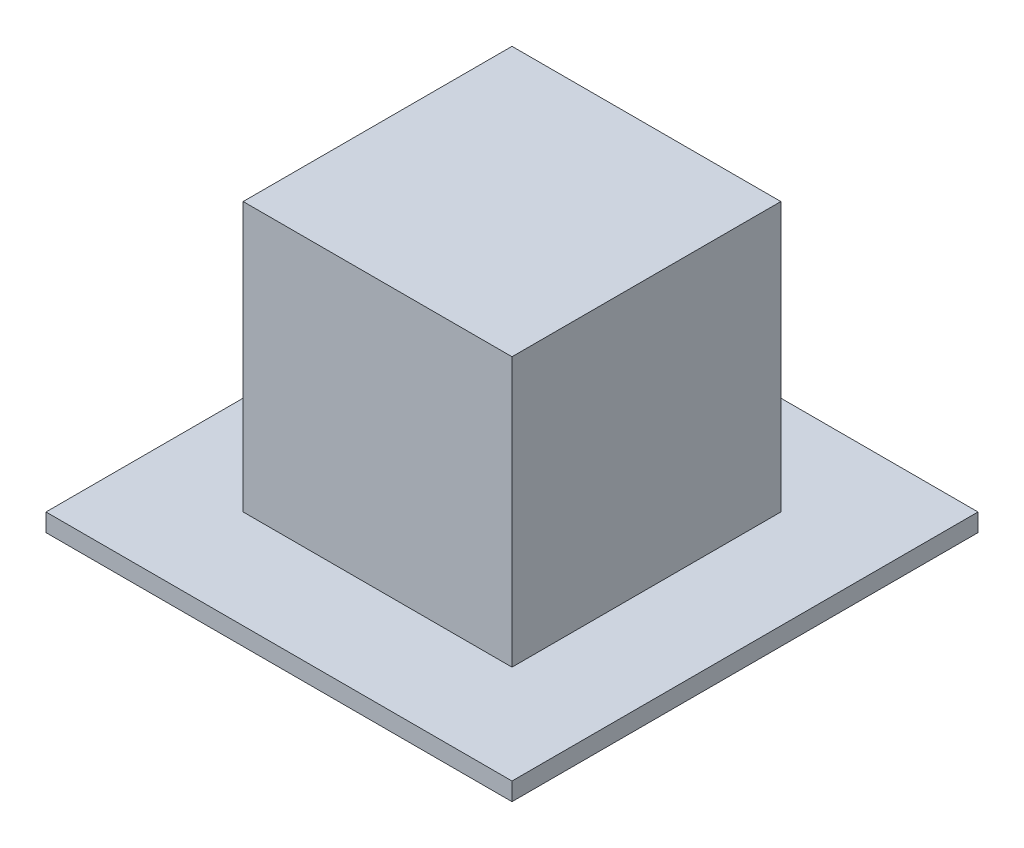
ISO-10303-21;
HEADER;
FILE_DESCRIPTION(('STEP AP214'),'2;1');
FILE_NAME('part.step','',(''),(''),'','','');
FILE_SCHEMA(('AUTOMOTIVE_DESIGN { 1 0 10303 214 1 1 1 1 }'));
ENDSEC;
DATA;
#1=APPLICATION_CONTEXT('core data for automotive mechanical design processes');
#2=APPLICATION_PROTOCOL_DEFINITION('international standard','automotive_design',2000,#1);
#3=PRODUCT_CONTEXT('',#1,'mechanical');
#4=PRODUCT('Part','Part','',(#3));
#5=PRODUCT_RELATED_PRODUCT_CATEGORY('part','',(#4));
#6=PRODUCT_DEFINITION_FORMATION('','',#4);
#7=PRODUCT_DEFINITION_CONTEXT('part definition',#1,'design');
#8=PRODUCT_DEFINITION('design','',#6,#7);
#9=PRODUCT_DEFINITION_SHAPE('','',#8);
#10=(LENGTH_UNIT() NAMED_UNIT(*) SI_UNIT(.MILLI.,.METRE.));
#11=(NAMED_UNIT(*) PLANE_ANGLE_UNIT() SI_UNIT($,.RADIAN.));
#12=(NAMED_UNIT(*) SI_UNIT($,.STERADIAN.) SOLID_ANGLE_UNIT());
#13=UNCERTAINTY_MEASURE_WITH_UNIT(LENGTH_MEASURE(1.E-05),#10,'distance_accuracy_value','');
#14=(GEOMETRIC_REPRESENTATION_CONTEXT(3) GLOBAL_UNCERTAINTY_ASSIGNED_CONTEXT((#13)) GLOBAL_UNIT_ASSIGNED_CONTEXT((#10,
#11,#12)) REPRESENTATION_CONTEXT('',''));
#15=CARTESIAN_POINT('',(0.,0.,0.));
#16=DIRECTION('',(0.,0.,1.));
#17=DIRECTION('',(1.,0.,0.));
#18=AXIS2_PLACEMENT_3D('',#15,#16,#17);
#19=CARTESIAN_POINT('',(-7.5,15.,7.5));
#20=DIRECTION('',(1.,0.,0.));
#21=DIRECTION('',(0.,0.,-1.));
#22=AXIS2_PLACEMENT_3D('',#19,#20,#21);
#23=PLANE('',#22);
#24=DIRECTION('',(0.,0.,1.));
#25=VECTOR('',#24,1.);
#26=CARTESIAN_POINT('',(-7.5,0.,7.5));
#27=LINE('',#26,#25);
#28=CARTESIAN_POINT('',(-7.5,0.,-7.5));
#29=VERTEX_POINT('',#28);
#30=CARTESIAN_POINT('',(-7.5,0.,7.5));
#31=VERTEX_POINT('',#30);
#32=EDGE_CURVE('E120',#29,#31,#27,.T.);
#33=ORIENTED_EDGE('',*,*,#32,.T.);
#34=DIRECTION('',(0.,-1.,0.));
#35=VECTOR('',#34,1.);
#36=CARTESIAN_POINT('',(-7.5,15.,7.5));
#37=LINE('',#36,#35);
#38=CARTESIAN_POINT('',(-7.5,15.,7.5));
#39=VERTEX_POINT('',#38);
#40=EDGE_CURVE('E11',#39,#31,#37,.T.);
#41=ORIENTED_EDGE('',*,*,#40,.F.);
#42=DIRECTION('',(0.,0.,1.));
#43=VECTOR('',#42,1.);
#44=CARTESIAN_POINT('',(-7.5,15.,7.5));
#45=LINE('',#44,#43);
#46=CARTESIAN_POINT('',(-7.5,15.,-7.5));
#47=VERTEX_POINT('',#46);
#48=EDGE_CURVE('E129',#47,#39,#45,.T.);
#49=ORIENTED_EDGE('',*,*,#48,.F.);
#50=DIRECTION('',(0.,-1.,0.));
#51=VECTOR('',#50,1.);
#52=CARTESIAN_POINT('',(-7.5,15.,-7.5));
#53=LINE('',#52,#51);
#54=EDGE_CURVE('E136',#47,#29,#53,.T.);
#55=ORIENTED_EDGE('',*,*,#54,.T.);
#56=EDGE_LOOP('',(#33,#41,#49,#55));
#57=FACE_BOUND('',#56,.T.);
#58=ADVANCED_FACE('F35',(#57),#23,.F.);
#59=CARTESIAN_POINT('',(7.5,15.,7.5));
#60=DIRECTION('',(0.,0.,-1.));
#61=DIRECTION('',(-1.,0.,0.));
#62=AXIS2_PLACEMENT_3D('',#59,#60,#61);
#63=PLANE('',#62);
#64=DIRECTION('',(1.,0.,0.));
#65=VECTOR('',#64,1.);
#66=CARTESIAN_POINT('',(7.5,0.,7.5));
#67=LINE('',#66,#65);
#68=CARTESIAN_POINT('',(7.5,0.,7.5));
#69=VERTEX_POINT('',#68);
#70=EDGE_CURVE('E123',#31,#69,#67,.T.);
#71=ORIENTED_EDGE('',*,*,#70,.T.);
#72=DIRECTION('',(0.,-1.,0.));
#73=VECTOR('',#72,1.);
#74=CARTESIAN_POINT('',(7.5,15.,7.5));
#75=LINE('',#74,#73);
#76=CARTESIAN_POINT('',(7.5,15.,7.5));
#77=VERTEX_POINT('',#76);
#78=EDGE_CURVE('E43',#77,#69,#75,.T.);
#79=ORIENTED_EDGE('',*,*,#78,.F.);
#80=DIRECTION('',(1.,0.,0.));
#81=VECTOR('',#80,1.);
#82=CARTESIAN_POINT('',(7.5,15.,7.5));
#83=LINE('',#82,#81);
#84=EDGE_CURVE('E131',#39,#77,#83,.T.);
#85=ORIENTED_EDGE('',*,*,#84,.F.);
#86=ORIENTED_EDGE('',*,*,#40,.T.);
#87=EDGE_LOOP('',(#71,#79,#85,#86));
#88=FACE_BOUND('',#87,.T.);
#89=ADVANCED_FACE('F156',(#88),#63,.F.);
#90=CARTESIAN_POINT('',(7.5,15.,7.5));
#91=DIRECTION('',(-1.,0.,0.));
#92=DIRECTION('',(0.,0.,1.));
#93=AXIS2_PLACEMENT_3D('',#90,#91,#92);
#94=PLANE('',#93);
#95=DIRECTION('',(0.,0.,-1.));
#96=VECTOR('',#95,1.);
#97=CARTESIAN_POINT('',(7.5,0.,7.5));
#98=LINE('',#97,#96);
#99=CARTESIAN_POINT('',(7.5,0.,-7.5));
#100=VERTEX_POINT('',#99);
#101=EDGE_CURVE('E140',#69,#100,#98,.T.);
#102=ORIENTED_EDGE('',*,*,#101,.T.);
#103=DIRECTION('',(0.,-1.,0.));
#104=VECTOR('',#103,1.);
#105=CARTESIAN_POINT('',(7.5,15.,-7.5));
#106=LINE('',#105,#104);
#107=CARTESIAN_POINT('',(7.5,15.,-7.5));
#108=VERTEX_POINT('',#107);
#109=EDGE_CURVE('E147',#108,#100,#106,.T.);
#110=ORIENTED_EDGE('',*,*,#109,.F.);
#111=DIRECTION('',(0.,0.,-1.));
#112=VECTOR('',#111,1.);
#113=CARTESIAN_POINT('',(7.5,15.,7.5));
#114=LINE('',#113,#112);
#115=EDGE_CURVE('E134',#77,#108,#114,.T.);
#116=ORIENTED_EDGE('',*,*,#115,.F.);
#117=ORIENTED_EDGE('',*,*,#78,.T.);
#118=EDGE_LOOP('',(#102,#110,#116,#117));
#119=FACE_BOUND('',#118,.T.);
#120=ADVANCED_FACE('F153',(#119),#94,.F.);
#121=CARTESIAN_POINT('',(7.5,15.,-7.5));
#122=DIRECTION('',(0.,0.,1.));
#123=DIRECTION('',(1.,0.,0.));
#124=AXIS2_PLACEMENT_3D('',#121,#122,#123);
#125=PLANE('',#124);
#126=DIRECTION('',(-1.,0.,0.));
#127=VECTOR('',#126,1.);
#128=CARTESIAN_POINT('',(7.5,0.,-7.5));
#129=LINE('',#128,#127);
#130=EDGE_CURVE('E132',#100,#29,#129,.T.);
#131=ORIENTED_EDGE('',*,*,#130,.T.);
#132=ORIENTED_EDGE('',*,*,#54,.F.);
#133=DIRECTION('',(-1.,0.,0.));
#134=VECTOR('',#133,1.);
#135=CARTESIAN_POINT('',(7.5,15.,-7.5));
#136=LINE('',#135,#134);
#137=EDGE_CURVE('E50',#108,#47,#136,.T.);
#138=ORIENTED_EDGE('',*,*,#137,.F.);
#139=ORIENTED_EDGE('',*,*,#109,.T.);
#140=EDGE_LOOP('',(#131,#132,#138,#139));
#141=FACE_BOUND('',#140,.T.);
#142=ADVANCED_FACE('F162',(#141),#125,.F.);
#143=CARTESIAN_POINT('',(0.,15.,0.));
#144=DIRECTION('',(0.,1.,0.));
#145=DIRECTION('',(0.,0.,1.));
#146=AXIS2_PLACEMENT_3D('',#143,#144,#145);
#147=PLANE('',#146);
#148=ORIENTED_EDGE('',*,*,#48,.T.);
#149=ORIENTED_EDGE('',*,*,#84,.T.);
#150=ORIENTED_EDGE('',*,*,#115,.T.);
#151=ORIENTED_EDGE('',*,*,#137,.T.);
#152=EDGE_LOOP('',(#148,#149,#150,#151));
#153=FACE_BOUND('',#152,.T.);
#154=ADVANCED_FACE('F165',(#153),#147,.T.);
#155=CARTESIAN_POINT('',(0.,0.,0.));
#156=DIRECTION('',(0.,-1.,0.));
#157=DIRECTION('',(0.,0.,-1.));
#158=AXIS2_PLACEMENT_3D('',#155,#156,#157);
#159=PLANE('',#158);
#160=DIRECTION('',(-1.,0.,0.));
#161=VECTOR('',#160,1.);
#162=CARTESIAN_POINT('',(13.,0.,13.));
#163=LINE('',#162,#161);
#164=CARTESIAN_POINT('',(13.,0.,13.));
#165=VERTEX_POINT('',#164);
#166=CARTESIAN_POINT('',(-13.,0.,13.));
#167=VERTEX_POINT('',#166);
#168=EDGE_CURVE('E119',#165,#167,#163,.T.);
#169=ORIENTED_EDGE('',*,*,#168,.F.);
#170=DIRECTION('',(0.,0.,1.));
#171=VECTOR('',#170,1.);
#172=CARTESIAN_POINT('',(13.,0.,-13.));
#173=LINE('',#172,#171);
#174=CARTESIAN_POINT('',(13.,0.,-13.));
#175=VERTEX_POINT('',#174);
#176=EDGE_CURVE('E115',#175,#165,#173,.T.);
#177=ORIENTED_EDGE('',*,*,#176,.F.);
#178=DIRECTION('',(1.,0.,0.));
#179=VECTOR('',#178,1.);
#180=CARTESIAN_POINT('',(-13.,0.,-13.));
#181=LINE('',#180,#179);
#182=CARTESIAN_POINT('',(-13.,0.,-13.));
#183=VERTEX_POINT('',#182);
#184=EDGE_CURVE('E249',#183,#175,#181,.T.);
#185=ORIENTED_EDGE('',*,*,#184,.F.);
#186=DIRECTION('',(0.,0.,-1.));
#187=VECTOR('',#186,1.);
#188=CARTESIAN_POINT('',(-13.,0.,13.));
#189=LINE('',#188,#187);
#190=EDGE_CURVE('E252',#167,#183,#189,.T.);
#191=ORIENTED_EDGE('',*,*,#190,.F.);
#192=EDGE_LOOP('',(#169,#177,#185,#191));
#193=FACE_BOUND('',#192,.T.);
#194=ORIENTED_EDGE('',*,*,#70,.F.);
#195=ORIENTED_EDGE('',*,*,#32,.F.);
#196=ORIENTED_EDGE('',*,*,#130,.F.);
#197=ORIENTED_EDGE('',*,*,#101,.F.);
#198=EDGE_LOOP('',(#194,#195,#196,#197));
#199=FACE_BOUND('',#198,.T.);
#200=ADVANCED_FACE('F160',(#193,#199),#159,.F.);
#201=CARTESIAN_POINT('',(13.,-1.,13.));
#202=DIRECTION('',(0.,0.,-1.));
#203=DIRECTION('',(-1.,0.,0.));
#204=AXIS2_PLACEMENT_3D('',#201,#202,#203);
#205=PLANE('',#204);
#206=ORIENTED_EDGE('',*,*,#168,.T.);
#207=DIRECTION('',(0.,1.,0.));
#208=VECTOR('',#207,1.);
#209=CARTESIAN_POINT('',(-13.,-1.,13.));
#210=LINE('',#209,#208);
#211=CARTESIAN_POINT('',(-13.,-1.,13.));
#212=VERTEX_POINT('',#211);
#213=EDGE_CURVE('E99',#212,#167,#210,.T.);
#214=ORIENTED_EDGE('',*,*,#213,.F.);
#215=DIRECTION('',(-1.,0.,0.));
#216=VECTOR('',#215,1.);
#217=CARTESIAN_POINT('',(13.,-1.,13.));
#218=LINE('',#217,#216);
#219=CARTESIAN_POINT('',(13.,-1.,13.));
#220=VERTEX_POINT('',#219);
#221=EDGE_CURVE('E106',#220,#212,#218,.T.);
#222=ORIENTED_EDGE('',*,*,#221,.F.);
#223=DIRECTION('',(0.,1.,0.));
#224=VECTOR('',#223,1.);
#225=CARTESIAN_POINT('',(13.,-1.,13.));
#226=LINE('',#225,#224);
#227=EDGE_CURVE('E246',#220,#165,#226,.T.);
#228=ORIENTED_EDGE('',*,*,#227,.T.);
#229=EDGE_LOOP('',(#206,#214,#222,#228));
#230=FACE_BOUND('',#229,.T.);
#231=ADVANCED_FACE('F117',(#230),#205,.F.);
#232=CARTESIAN_POINT('',(-13.,-1.,13.));
#233=DIRECTION('',(1.,0.,0.));
#234=DIRECTION('',(0.,0.,-1.));
#235=AXIS2_PLACEMENT_3D('',#232,#233,#234);
#236=PLANE('',#235);
#237=ORIENTED_EDGE('',*,*,#190,.T.);
#238=DIRECTION('',(0.,1.,0.));
#239=VECTOR('',#238,1.);
#240=CARTESIAN_POINT('',(-13.,-1.,-13.));
#241=LINE('',#240,#239);
#242=CARTESIAN_POINT('',(-13.,-1.,-13.));
#243=VERTEX_POINT('',#242);
#244=EDGE_CURVE('E102',#243,#183,#241,.T.);
#245=ORIENTED_EDGE('',*,*,#244,.F.);
#246=DIRECTION('',(0.,0.,-1.));
#247=VECTOR('',#246,1.);
#248=CARTESIAN_POINT('',(-13.,-1.,13.));
#249=LINE('',#248,#247);
#250=EDGE_CURVE('E95',#212,#243,#249,.T.);
#251=ORIENTED_EDGE('',*,*,#250,.F.);
#252=ORIENTED_EDGE('',*,*,#213,.T.);
#253=EDGE_LOOP('',(#237,#245,#251,#252));
#254=FACE_BOUND('',#253,.T.);
#255=ADVANCED_FACE('F97',(#254),#236,.F.);
#256=CARTESIAN_POINT('',(-13.,-1.,-13.));
#257=DIRECTION('',(0.,0.,1.));
#258=DIRECTION('',(1.,0.,0.));
#259=AXIS2_PLACEMENT_3D('',#256,#257,#258);
#260=PLANE('',#259);
#261=ORIENTED_EDGE('',*,*,#184,.T.);
#262=DIRECTION('',(0.,1.,0.));
#263=VECTOR('',#262,1.);
#264=CARTESIAN_POINT('',(13.,-1.,-13.));
#265=LINE('',#264,#263);
#266=CARTESIAN_POINT('',(13.,-1.,-13.));
#267=VERTEX_POINT('',#266);
#268=EDGE_CURVE('E125',#267,#175,#265,.T.);
#269=ORIENTED_EDGE('',*,*,#268,.F.);
#270=DIRECTION('',(1.,0.,0.));
#271=VECTOR('',#270,1.);
#272=CARTESIAN_POINT('',(-13.,-1.,-13.));
#273=LINE('',#272,#271);
#274=EDGE_CURVE('E105',#243,#267,#273,.T.);
#275=ORIENTED_EDGE('',*,*,#274,.F.);
#276=ORIENTED_EDGE('',*,*,#244,.T.);
#277=EDGE_LOOP('',(#261,#269,#275,#276));
#278=FACE_BOUND('',#277,.T.);
#279=ADVANCED_FACE('F213',(#278),#260,.F.);
#280=CARTESIAN_POINT('',(13.,-1.,-13.));
#281=DIRECTION('',(-1.,0.,0.));
#282=DIRECTION('',(0.,0.,1.));
#283=AXIS2_PLACEMENT_3D('',#280,#281,#282);
#284=PLANE('',#283);
#285=ORIENTED_EDGE('',*,*,#176,.T.);
#286=ORIENTED_EDGE('',*,*,#227,.F.);
#287=DIRECTION('',(0.,0.,1.));
#288=VECTOR('',#287,1.);
#289=CARTESIAN_POINT('',(13.,-1.,-13.));
#290=LINE('',#289,#288);
#291=EDGE_CURVE('E111',#267,#220,#290,.T.);
#292=ORIENTED_EDGE('',*,*,#291,.F.);
#293=ORIENTED_EDGE('',*,*,#268,.T.);
#294=EDGE_LOOP('',(#285,#286,#292,#293));
#295=FACE_BOUND('',#294,.T.);
#296=ADVANCED_FACE('F222',(#295),#284,.F.);
#297=CARTESIAN_POINT('',(0.,-1.,0.));
#298=DIRECTION('',(0.,-1.,0.));
#299=DIRECTION('',(0.,0.,-1.));
#300=AXIS2_PLACEMENT_3D('',#297,#298,#299);
#301=PLANE('',#300);
#302=ORIENTED_EDGE('',*,*,#221,.T.);
#303=ORIENTED_EDGE('',*,*,#250,.T.);
#304=ORIENTED_EDGE('',*,*,#274,.T.);
#305=ORIENTED_EDGE('',*,*,#291,.T.);
#306=EDGE_LOOP('',(#302,#303,#304,#305));
#307=FACE_BOUND('',#306,.T.);
#308=ADVANCED_FACE('F109',(#307),#301,.T.);
#309=CLOSED_SHELL('',(#58,#89,#120,#142,#154,#200,#231,#255,#279,#296,#308));
#310=MANIFOLD_SOLID_BREP('B2',#309);
#311=ADVANCED_BREP_SHAPE_REPRESENTATION('',(#18,#310),#14);
#312=SHAPE_DEFINITION_REPRESENTATION(#9,#311);
ENDSEC;
END-ISO-10303-21;
